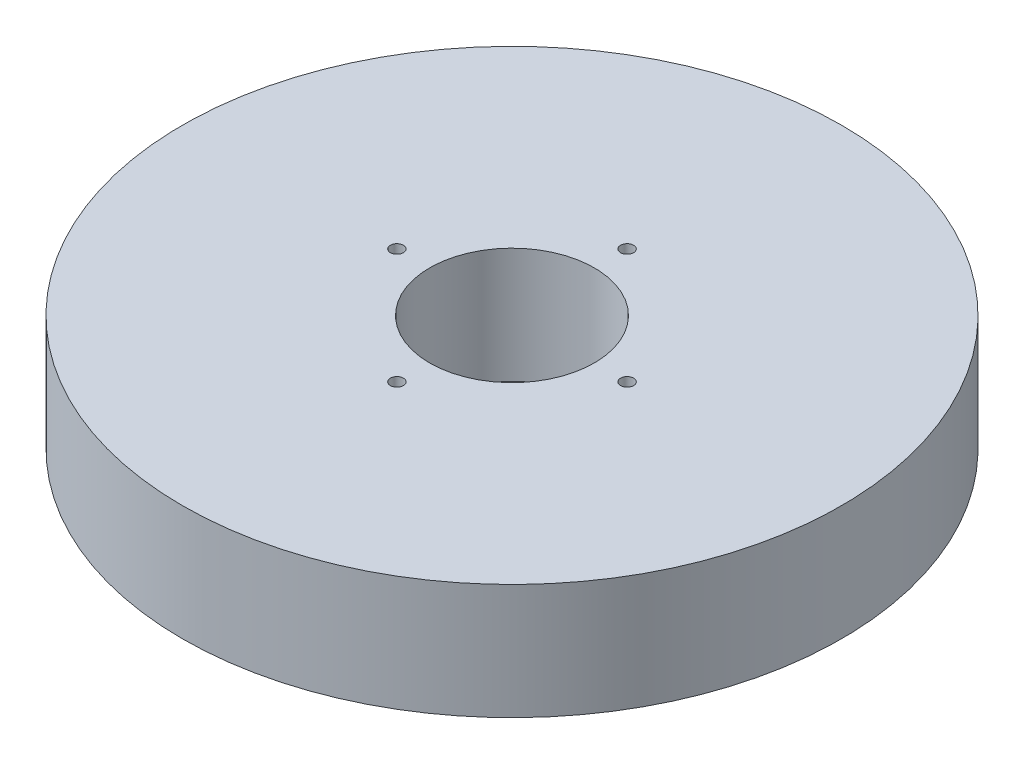
ISO-10303-21;
HEADER;
FILE_DESCRIPTION(('STEP AP214'),'2;1');
FILE_NAME('part.step','',(''),(''),'','','');
FILE_SCHEMA(('AUTOMOTIVE_DESIGN { 1 0 10303 214 1 1 1 1 }'));
ENDSEC;
DATA;
#1=APPLICATION_CONTEXT('core data for automotive mechanical design processes');
#2=APPLICATION_PROTOCOL_DEFINITION('international standard','automotive_design',2000,#1);
#3=PRODUCT_CONTEXT('',#1,'mechanical');
#4=PRODUCT('Part','Part','',(#3));
#5=PRODUCT_RELATED_PRODUCT_CATEGORY('part','',(#4));
#6=PRODUCT_DEFINITION_FORMATION('','',#4);
#7=PRODUCT_DEFINITION_CONTEXT('part definition',#1,'design');
#8=PRODUCT_DEFINITION('design','',#6,#7);
#9=PRODUCT_DEFINITION_SHAPE('','',#8);
#10=(LENGTH_UNIT() NAMED_UNIT(*) SI_UNIT(.MILLI.,.METRE.));
#11=(NAMED_UNIT(*) PLANE_ANGLE_UNIT() SI_UNIT($,.RADIAN.));
#12=(NAMED_UNIT(*) SI_UNIT($,.STERADIAN.) SOLID_ANGLE_UNIT());
#13=UNCERTAINTY_MEASURE_WITH_UNIT(LENGTH_MEASURE(1.E-05),#10,'distance_accuracy_value','');
#14=(GEOMETRIC_REPRESENTATION_CONTEXT(3) GLOBAL_UNCERTAINTY_ASSIGNED_CONTEXT((#13)) GLOBAL_UNIT_ASSIGNED_CONTEXT((#10,
#11,#12)) REPRESENTATION_CONTEXT('',''));
#15=CARTESIAN_POINT('',(0.,0.,0.));
#16=DIRECTION('',(0.,0.,1.));
#17=DIRECTION('',(1.,0.,0.));
#18=AXIS2_PLACEMENT_3D('',#15,#16,#17);
#19=CARTESIAN_POINT('',(0.,28.,0.));
#20=DIRECTION('',(0.,-1.,0.));
#21=DIRECTION('',(0.,0.,-1.));
#22=AXIS2_PLACEMENT_3D('',#19,#20,#21);
#23=CYLINDRICAL_SURFACE('',#22,80.);
#24=CARTESIAN_POINT('',(0.,28.,0.));
#25=DIRECTION('',(0.,1.,0.));
#26=DIRECTION('',(0.,0.,1.));
#27=AXIS2_PLACEMENT_3D('',#24,#25,#26);
#28=CIRCLE('',#27,80.);
#29=CARTESIAN_POINT('',(0.,28.,80.));
#30=VERTEX_POINT('',#29);
#31=EDGE_CURVE('E10',#30,#30,#28,.T.);
#32=ORIENTED_EDGE('',*,*,#31,.F.);
#33=EDGE_LOOP('',(#32));
#34=FACE_BOUND('',#33,.T.);
#35=CARTESIAN_POINT('',(0.,0.,0.));
#36=DIRECTION('',(0.,1.,0.));
#37=DIRECTION('',(0.,0.,1.));
#38=AXIS2_PLACEMENT_3D('',#35,#36,#37);
#39=CIRCLE('',#38,80.);
#40=CARTESIAN_POINT('',(0.,0.,80.));
#41=VERTEX_POINT('',#40);
#42=EDGE_CURVE('E37',#41,#41,#39,.T.);
#43=ORIENTED_EDGE('',*,*,#42,.T.);
#44=EDGE_LOOP('',(#43));
#45=FACE_BOUND('',#44,.T.);
#46=ADVANCED_FACE('F40',(#34,#45),#23,.T.);
#47=CARTESIAN_POINT('',(0.,28.,0.));
#48=DIRECTION('',(0.,1.,0.));
#49=DIRECTION('',(0.,0.,1.));
#50=AXIS2_PLACEMENT_3D('',#47,#48,#49);
#51=PLANE('',#50);
#52=CARTESIAN_POINT('',(0.,28.,27.9420046027458));
#53=DIRECTION('',(0.,1.,0.));
#54=DIRECTION('',(1.,0.,0.));
#55=AXIS2_PLACEMENT_3D('',#52,#53,#54);
#56=CIRCLE('',#55,1.57781303984498);
#57=CARTESIAN_POINT('',(1.57781303984508,28.,27.9420046027458));
#58=VERTEX_POINT('',#57);
#59=EDGE_CURVE('E71',#58,#58,#56,.T.);
#60=ORIENTED_EDGE('',*,*,#59,.F.);
#61=EDGE_LOOP('',(#60));
#62=FACE_BOUND('',#61,.T.);
#63=CARTESIAN_POINT('',(27.9420046027458,28.,0.));
#64=DIRECTION('',(0.,1.,0.));
#65=DIRECTION('',(0.,0.,-1.));
#66=AXIS2_PLACEMENT_3D('',#63,#64,#65);
#67=CIRCLE('',#66,1.57781303984498);
#68=CARTESIAN_POINT('',(27.9420046027458,28.,-1.57781303984498));
#69=VERTEX_POINT('',#68);
#70=EDGE_CURVE('E70',#69,#69,#67,.T.);
#71=ORIENTED_EDGE('',*,*,#70,.F.);
#72=EDGE_LOOP('',(#71));
#73=FACE_BOUND('',#72,.T.);
#74=CARTESIAN_POINT('',(-2.92676962921068E-13,28.,-27.9420046027458));
#75=DIRECTION('',(0.,1.,0.));
#76=DIRECTION('',(-1.,0.,0.));
#77=AXIS2_PLACEMENT_3D('',#74,#75,#76);
#78=CIRCLE('',#77,1.57781303984498);
#79=CARTESIAN_POINT('',(-1.57781303984528,28.,-27.9420046027458));
#80=VERTEX_POINT('',#79);
#81=EDGE_CURVE('E61',#80,#80,#78,.T.);
#82=ORIENTED_EDGE('',*,*,#81,.F.);
#83=EDGE_LOOP('',(#82));
#84=FACE_BOUND('',#83,.T.);
#85=CARTESIAN_POINT('',(-27.9420046027458,28.,0.));
#86=DIRECTION('',(0.,1.,0.));
#87=DIRECTION('',(0.,0.,1.));
#88=AXIS2_PLACEMENT_3D('',#85,#86,#87);
#89=CIRCLE('',#88,1.57781303984498);
#90=CARTESIAN_POINT('',(-27.9420046027458,28.,1.57781303984498));
#91=VERTEX_POINT('',#90);
#92=EDGE_CURVE('E54',#91,#91,#89,.T.);
#93=ORIENTED_EDGE('',*,*,#92,.F.);
#94=EDGE_LOOP('',(#93));
#95=FACE_BOUND('',#94,.T.);
#96=CARTESIAN_POINT('',(0.,28.,0.));
#97=DIRECTION('',(0.,1.,0.));
#98=DIRECTION('',(0.,0.,1.));
#99=AXIS2_PLACEMENT_3D('',#96,#97,#98);
#100=CIRCLE('',#99,20.);
#101=CARTESIAN_POINT('',(0.,28.,20.));
#102=VERTEX_POINT('',#101);
#103=EDGE_CURVE('E50',#102,#102,#100,.T.);
#104=ORIENTED_EDGE('',*,*,#103,.F.);
#105=EDGE_LOOP('',(#104));
#106=FACE_BOUND('',#105,.T.);
#107=ORIENTED_EDGE('',*,*,#31,.T.);
#108=EDGE_LOOP('',(#107));
#109=FACE_BOUND('',#108,.T.);
#110=ADVANCED_FACE('F86',(#62,#73,#84,#95,#106,#109),#51,.T.);
#111=CARTESIAN_POINT('',(0.,0.,0.));
#112=DIRECTION('',(0.,1.,0.));
#113=DIRECTION('',(0.,0.,1.));
#114=AXIS2_PLACEMENT_3D('',#111,#112,#113);
#115=PLANE('',#114);
#116=CARTESIAN_POINT('',(0.,0.,0.));
#117=DIRECTION('',(0.,1.,0.));
#118=DIRECTION('',(0.,0.,1.));
#119=AXIS2_PLACEMENT_3D('',#116,#117,#118);
#120=CIRCLE('',#119,20.);
#121=CARTESIAN_POINT('',(0.,0.,20.));
#122=VERTEX_POINT('',#121);
#123=EDGE_CURVE('E47',#122,#122,#120,.T.);
#124=ORIENTED_EDGE('',*,*,#123,.T.);
#125=EDGE_LOOP('',(#124));
#126=FACE_BOUND('',#125,.T.);
#127=ORIENTED_EDGE('',*,*,#42,.F.);
#128=EDGE_LOOP('',(#127));
#129=FACE_BOUND('',#128,.T.);
#130=ADVANCED_FACE('F93',(#126,#129),#115,.F.);
#131=CARTESIAN_POINT('',(0.,28.,0.));
#132=DIRECTION('',(0.,-1.,0.));
#133=DIRECTION('',(0.,0.,-1.));
#134=AXIS2_PLACEMENT_3D('',#131,#132,#133);
#135=CYLINDRICAL_SURFACE('',#134,20.);
#136=ORIENTED_EDGE('',*,*,#103,.T.);
#137=EDGE_LOOP('',(#136));
#138=FACE_BOUND('',#137,.T.);
#139=ORIENTED_EDGE('',*,*,#123,.F.);
#140=EDGE_LOOP('',(#139));
#141=FACE_BOUND('',#140,.T.);
#142=ADVANCED_FACE('F101',(#138,#141),#135,.F.);
#143=CARTESIAN_POINT('',(-27.9420046027458,5.63141961682939,0.));
#144=DIRECTION('',(0.,1.,0.));
#145=DIRECTION('',(0.,0.,1.));
#146=AXIS2_PLACEMENT_3D('',#143,#144,#145);
#147=CYLINDRICAL_SURFACE('',#146,1.57781303984498);
#148=CARTESIAN_POINT('',(-27.9420046027458,5.63141961682939,0.));
#149=DIRECTION('',(0.,1.,0.));
#150=DIRECTION('',(0.,0.,1.));
#151=AXIS2_PLACEMENT_3D('',#148,#149,#150);
#152=CIRCLE('',#151,1.57781303984498);
#153=CARTESIAN_POINT('',(-27.9420046027458,5.63141961682939,1.57781303984498));
#154=VERTEX_POINT('',#153);
#155=EDGE_CURVE('E55',#154,#154,#152,.T.);
#156=ORIENTED_EDGE('',*,*,#155,.F.);
#157=EDGE_LOOP('',(#156));
#158=FACE_BOUND('',#157,.T.);
#159=ORIENTED_EDGE('',*,*,#92,.T.);
#160=EDGE_LOOP('',(#159));
#161=FACE_BOUND('',#160,.T.);
#162=ADVANCED_FACE('F102',(#158,#161),#147,.F.);
#163=CARTESIAN_POINT('',(-27.9420046027458,5.63141961682939,0.));
#164=DIRECTION('',(0.,1.,0.));
#165=DIRECTION('',(0.,0.,1.));
#166=AXIS2_PLACEMENT_3D('',#163,#164,#165);
#167=PLANE('',#166);
#168=ORIENTED_EDGE('',*,*,#155,.T.);
#169=EDGE_LOOP('',(#168));
#170=FACE_BOUND('',#169,.T.);
#171=ADVANCED_FACE('F133',(#170),#167,.T.);
#172=CARTESIAN_POINT('',(-2.92676962921068E-13,5.63141961682939,-27.9420046027458));
#173=DIRECTION('',(0.,1.,0.));
#174=DIRECTION('',(0.,0.,1.));
#175=AXIS2_PLACEMENT_3D('',#172,#173,#174);
#176=CYLINDRICAL_SURFACE('',#175,1.57781303984498);
#177=CARTESIAN_POINT('',(-2.92676962921068E-13,5.63141961682939,-27.9420046027458));
#178=DIRECTION('',(0.,1.,0.));
#179=DIRECTION('',(-1.,0.,0.));
#180=AXIS2_PLACEMENT_3D('',#177,#178,#179);
#181=CIRCLE('',#180,1.57781303984498);
#182=CARTESIAN_POINT('',(-1.57781303984528,5.63141961682939,-27.9420046027458));
#183=VERTEX_POINT('',#182);
#184=EDGE_CURVE('E63',#183,#183,#181,.T.);
#185=ORIENTED_EDGE('',*,*,#184,.F.);
#186=EDGE_LOOP('',(#185));
#187=FACE_BOUND('',#186,.T.);
#188=ORIENTED_EDGE('',*,*,#81,.T.);
#189=EDGE_LOOP('',(#188));
#190=FACE_BOUND('',#189,.T.);
#191=ADVANCED_FACE('F142',(#187,#190),#176,.F.);
#192=CARTESIAN_POINT('',(-2.92676962921068E-13,5.63141961682939,-27.9420046027458));
#193=DIRECTION('',(0.,1.,0.));
#194=DIRECTION('',(-1.,0.,0.));
#195=AXIS2_PLACEMENT_3D('',#192,#193,#194);
#196=PLANE('',#195);
#197=ORIENTED_EDGE('',*,*,#184,.T.);
#198=EDGE_LOOP('',(#197));
#199=FACE_BOUND('',#198,.T.);
#200=ADVANCED_FACE('F156',(#199),#196,.T.);
#201=CARTESIAN_POINT('',(27.9420046027458,5.63141961682939,0.));
#202=DIRECTION('',(0.,1.,0.));
#203=DIRECTION('',(0.,0.,1.));
#204=AXIS2_PLACEMENT_3D('',#201,#202,#203);
#205=CYLINDRICAL_SURFACE('',#204,1.57781303984498);
#206=CARTESIAN_POINT('',(27.9420046027458,5.63141961682939,0.));
#207=DIRECTION('',(0.,1.,0.));
#208=DIRECTION('',(0.,0.,-1.));
#209=AXIS2_PLACEMENT_3D('',#206,#207,#208);
#210=CIRCLE('',#209,1.57781303984498);
#211=CARTESIAN_POINT('',(27.9420046027458,5.63141961682939,-1.57781303984498));
#212=VERTEX_POINT('',#211);
#213=EDGE_CURVE('E69',#212,#212,#210,.T.);
#214=ORIENTED_EDGE('',*,*,#213,.F.);
#215=EDGE_LOOP('',(#214));
#216=FACE_BOUND('',#215,.T.);
#217=ORIENTED_EDGE('',*,*,#70,.T.);
#218=EDGE_LOOP('',(#217));
#219=FACE_BOUND('',#218,.T.);
#220=ADVANCED_FACE('F164',(#216,#219),#205,.F.);
#221=CARTESIAN_POINT('',(27.9420046027458,5.63141961682939,0.));
#222=DIRECTION('',(0.,1.,0.));
#223=DIRECTION('',(0.,0.,-1.));
#224=AXIS2_PLACEMENT_3D('',#221,#222,#223);
#225=PLANE('',#224);
#226=ORIENTED_EDGE('',*,*,#213,.T.);
#227=EDGE_LOOP('',(#226));
#228=FACE_BOUND('',#227,.T.);
#229=ADVANCED_FACE('F83',(#228),#225,.T.);
#230=CARTESIAN_POINT('',(0.,5.63141961682939,27.9420046027458));
#231=DIRECTION('',(0.,1.,0.));
#232=DIRECTION('',(0.,0.,1.));
#233=AXIS2_PLACEMENT_3D('',#230,#231,#232);
#234=CYLINDRICAL_SURFACE('',#233,1.57781303984498);
#235=CARTESIAN_POINT('',(0.,5.63141961682939,27.9420046027458));
#236=DIRECTION('',(0.,1.,0.));
#237=DIRECTION('',(1.,0.,0.));
#238=AXIS2_PLACEMENT_3D('',#235,#236,#237);
#239=CIRCLE('',#238,1.57781303984498);
#240=CARTESIAN_POINT('',(1.57781303984508,5.63141961682939,27.9420046027458));
#241=VERTEX_POINT('',#240);
#242=EDGE_CURVE('E59',#241,#241,#239,.T.);
#243=ORIENTED_EDGE('',*,*,#242,.F.);
#244=EDGE_LOOP('',(#243));
#245=FACE_BOUND('',#244,.T.);
#246=ORIENTED_EDGE('',*,*,#59,.T.);
#247=EDGE_LOOP('',(#246));
#248=FACE_BOUND('',#247,.T.);
#249=ADVANCED_FACE('F81',(#245,#248),#234,.F.);
#250=CARTESIAN_POINT('',(0.,5.63141961682939,27.9420046027458));
#251=DIRECTION('',(0.,1.,0.));
#252=DIRECTION('',(1.,0.,0.));
#253=AXIS2_PLACEMENT_3D('',#250,#251,#252);
#254=PLANE('',#253);
#255=ORIENTED_EDGE('',*,*,#242,.T.);
#256=EDGE_LOOP('',(#255));
#257=FACE_BOUND('',#256,.T.);
#258=ADVANCED_FACE('F78',(#257),#254,.T.);
#259=CLOSED_SHELL('',(#46,#110,#130,#142,#162,#171,#191,#200,#220,#229,#249,#258));
#260=MANIFOLD_SOLID_BREP('B2',#259);
#261=ADVANCED_BREP_SHAPE_REPRESENTATION('',(#18,#260),#14);
#262=SHAPE_DEFINITION_REPRESENTATION(#9,#261);
ENDSEC;
END-ISO-10303-21;
